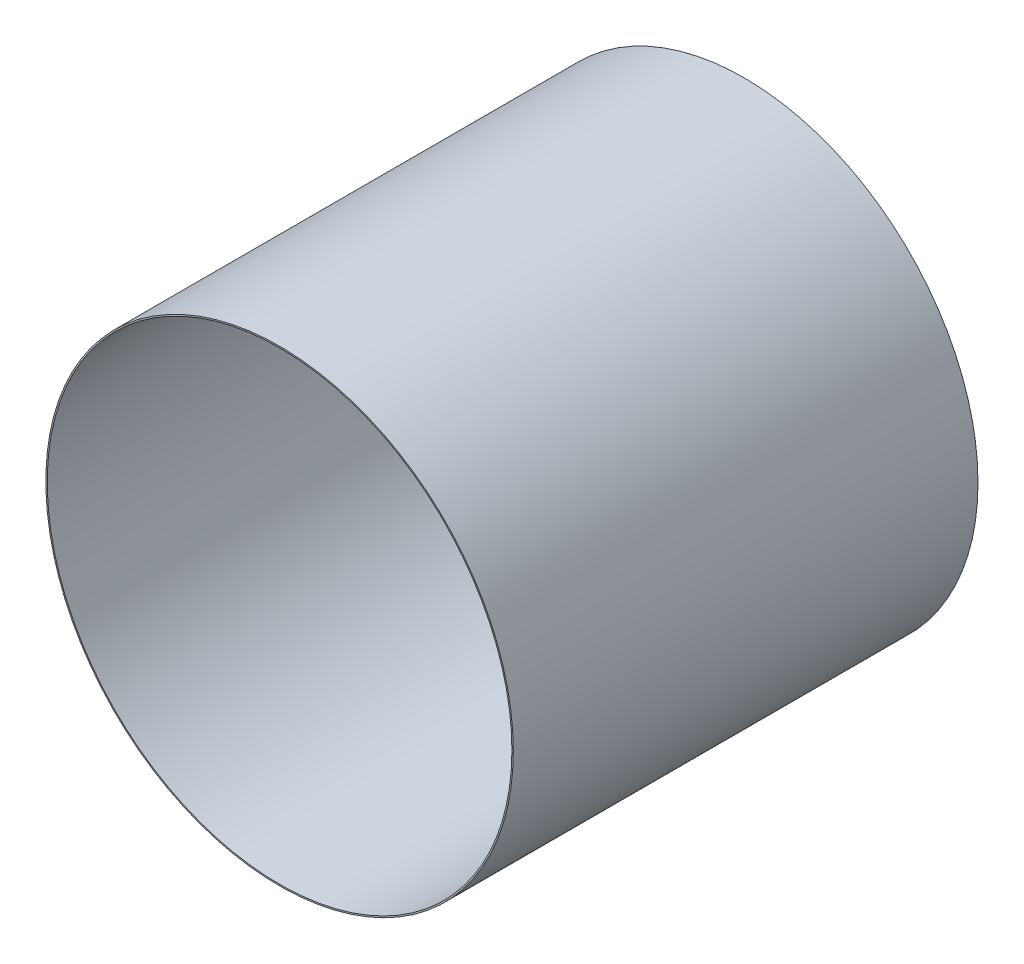
ISO-10303-21;
HEADER;
FILE_DESCRIPTION(('STEP AP214'),'2;1');
FILE_NAME('part.step','',(''),(''),'','','');
FILE_SCHEMA(('AUTOMOTIVE_DESIGN { 1 0 10303 214 1 1 1 1 }'));
ENDSEC;
DATA;
#1=APPLICATION_CONTEXT('core data for automotive mechanical design processes');
#2=APPLICATION_PROTOCOL_DEFINITION('international standard','automotive_design',2000,#1);
#3=PRODUCT_CONTEXT('',#1,'mechanical');
#4=PRODUCT('Part','Part','',(#3));
#5=PRODUCT_RELATED_PRODUCT_CATEGORY('part','',(#4));
#6=PRODUCT_DEFINITION_FORMATION('','',#4);
#7=PRODUCT_DEFINITION_CONTEXT('part definition',#1,'design');
#8=PRODUCT_DEFINITION('design','',#6,#7);
#9=PRODUCT_DEFINITION_SHAPE('','',#8);
#10=(LENGTH_UNIT() NAMED_UNIT(*) SI_UNIT(.MILLI.,.METRE.));
#11=(NAMED_UNIT(*) PLANE_ANGLE_UNIT() SI_UNIT($,.RADIAN.));
#12=(NAMED_UNIT(*) SI_UNIT($,.STERADIAN.) SOLID_ANGLE_UNIT());
#13=UNCERTAINTY_MEASURE_WITH_UNIT(LENGTH_MEASURE(1.E-05),#10,'distance_accuracy_value','');
#14=(GEOMETRIC_REPRESENTATION_CONTEXT(3) GLOBAL_UNCERTAINTY_ASSIGNED_CONTEXT((#13)) GLOBAL_UNIT_ASSIGNED_CONTEXT((#10,
#11,#12)) REPRESENTATION_CONTEXT('',''));
#15=CARTESIAN_POINT('',(0.,0.,0.));
#16=DIRECTION('',(0.,0.,1.));
#17=DIRECTION('',(1.,0.,0.));
#18=AXIS2_PLACEMENT_3D('',#15,#16,#17);
#19=CARTESIAN_POINT('',(0.,0.,-76.2));
#20=DIRECTION('',(0.,0.,1.));
#21=DIRECTION('',(1.,0.,0.));
#22=AXIS2_PLACEMENT_3D('',#19,#20,#21);
#23=CYLINDRICAL_SURFACE('',#22,38.32733);
#24=CARTESIAN_POINT('',(0.,0.,-76.2));
#25=DIRECTION('',(0.,0.,1.));
#26=DIRECTION('',(1.,0.,0.));
#27=AXIS2_PLACEMENT_3D('',#24,#25,#26);
#28=CIRCLE('',#27,38.32733);
#29=CARTESIAN_POINT('',(38.32733,0.,-76.2));
#30=VERTEX_POINT('',#29);
#31=EDGE_CURVE('E10',#30,#30,#28,.T.);
#32=ORIENTED_EDGE('',*,*,#31,.T.);
#33=EDGE_LOOP('',(#32));
#34=FACE_BOUND('',#33,.T.);
#35=CARTESIAN_POINT('',(0.,0.,0.));
#36=DIRECTION('',(0.,0.,1.));
#37=DIRECTION('',(1.,0.,0.));
#38=AXIS2_PLACEMENT_3D('',#35,#36,#37);
#39=CIRCLE('',#38,38.32733);
#40=CARTESIAN_POINT('',(38.32733,0.,0.));
#41=VERTEX_POINT('',#40);
#42=EDGE_CURVE('E38',#41,#41,#39,.T.);
#43=ORIENTED_EDGE('',*,*,#42,.F.);
#44=EDGE_LOOP('',(#43));
#45=FACE_BOUND('',#44,.T.);
#46=ADVANCED_FACE('F35',(#34,#45),#23,.T.);
#47=CARTESIAN_POINT('',(0.,0.,-76.2));
#48=DIRECTION('',(0.,0.,1.));
#49=DIRECTION('',(1.,0.,0.));
#50=AXIS2_PLACEMENT_3D('',#47,#48,#49);
#51=PLANE('',#50);
#52=CARTESIAN_POINT('',(0.,0.,-76.2));
#53=DIRECTION('',(0.,0.,1.));
#54=DIRECTION('',(1.,0.,0.));
#55=AXIS2_PLACEMENT_3D('',#52,#53,#54);
#56=CIRCLE('',#55,38.1);
#57=CARTESIAN_POINT('',(38.1,0.,-76.2));
#58=VERTEX_POINT('',#57);
#59=EDGE_CURVE('E45',#58,#58,#56,.T.);
#60=ORIENTED_EDGE('',*,*,#59,.T.);
#61=EDGE_LOOP('',(#60));
#62=FACE_BOUND('',#61,.T.);
#63=ORIENTED_EDGE('',*,*,#31,.F.);
#64=EDGE_LOOP('',(#63));
#65=FACE_BOUND('',#64,.T.);
#66=ADVANCED_FACE('F53',(#62,#65),#51,.F.);
#67=CARTESIAN_POINT('',(0.,0.,0.));
#68=DIRECTION('',(0.,0.,1.));
#69=DIRECTION('',(1.,0.,0.));
#70=AXIS2_PLACEMENT_3D('',#67,#68,#69);
#71=PLANE('',#70);
#72=CARTESIAN_POINT('',(0.,0.,0.));
#73=DIRECTION('',(0.,0.,1.));
#74=DIRECTION('',(1.,0.,0.));
#75=AXIS2_PLACEMENT_3D('',#72,#73,#74);
#76=CIRCLE('',#75,38.1);
#77=CARTESIAN_POINT('',(38.1,0.,0.));
#78=VERTEX_POINT('',#77);
#79=EDGE_CURVE('E47',#78,#78,#76,.T.);
#80=ORIENTED_EDGE('',*,*,#79,.F.);
#81=EDGE_LOOP('',(#80));
#82=FACE_BOUND('',#81,.T.);
#83=ORIENTED_EDGE('',*,*,#42,.T.);
#84=EDGE_LOOP('',(#83));
#85=FACE_BOUND('',#84,.T.);
#86=ADVANCED_FACE('F59',(#82,#85),#71,.T.);
#87=CARTESIAN_POINT('',(0.,0.,-76.2));
#88=DIRECTION('',(0.,0.,1.));
#89=DIRECTION('',(1.,0.,0.));
#90=AXIS2_PLACEMENT_3D('',#87,#88,#89);
#91=CYLINDRICAL_SURFACE('',#90,38.1);
#92=ORIENTED_EDGE('',*,*,#59,.F.);
#93=EDGE_LOOP('',(#92));
#94=FACE_BOUND('',#93,.T.);
#95=ORIENTED_EDGE('',*,*,#79,.T.);
#96=EDGE_LOOP('',(#95));
#97=FACE_BOUND('',#96,.T.);
#98=ADVANCED_FACE('F56',(#94,#97),#91,.F.);
#99=CLOSED_SHELL('',(#46,#66,#86,#98));
#100=MANIFOLD_SOLID_BREP('B2',#99);
#101=ADVANCED_BREP_SHAPE_REPRESENTATION('',(#18,#100),#14);
#102=SHAPE_DEFINITION_REPRESENTATION(#9,#101);
ENDSEC;
END-ISO-10303-21;
